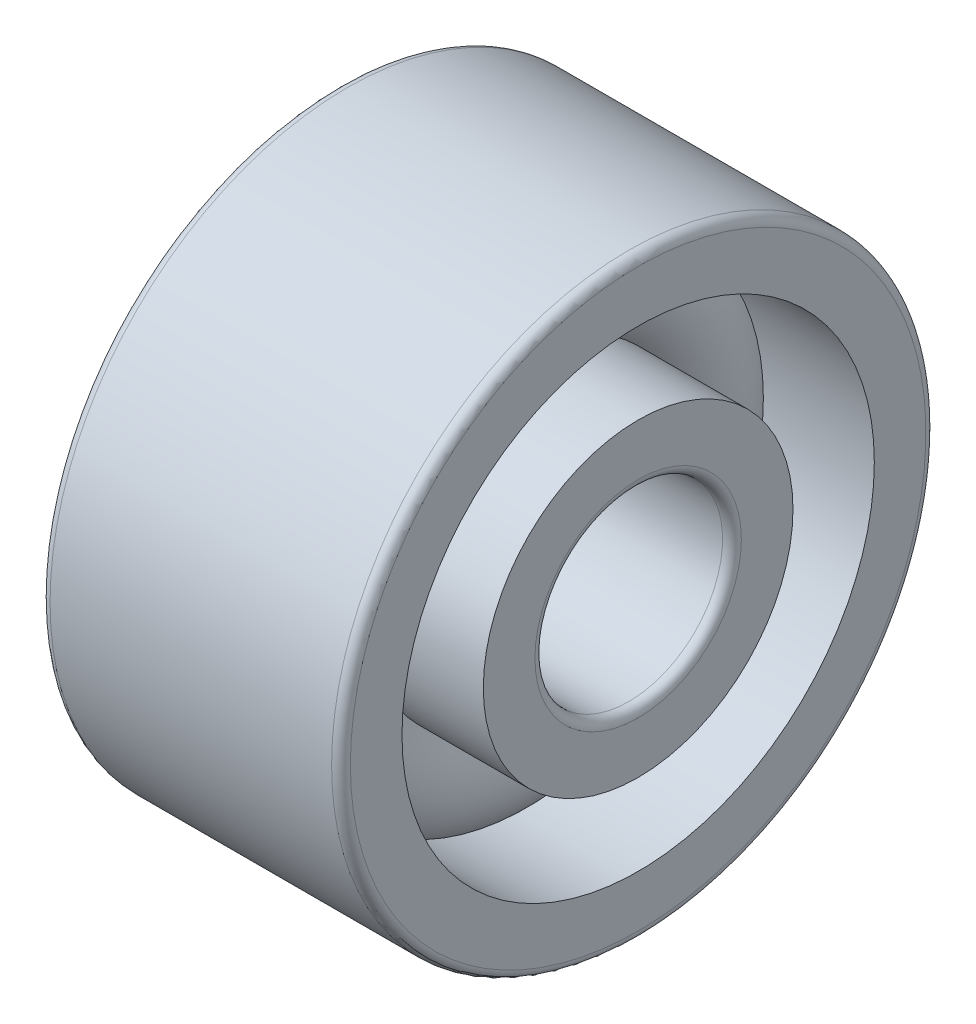
ISO-10303-21;
HEADER;
FILE_DESCRIPTION(('STEP AP214'),'2;1');
FILE_NAME('part.step','',(''),(''),'','','');
FILE_SCHEMA(('AUTOMOTIVE_DESIGN { 1 0 10303 214 1 1 1 1 }'));
ENDSEC;
DATA;
#1=APPLICATION_CONTEXT('core data for automotive mechanical design processes');
#2=APPLICATION_PROTOCOL_DEFINITION('international standard','automotive_design',2000,#1);
#3=PRODUCT_CONTEXT('',#1,'mechanical');
#4=PRODUCT('Part','Part','',(#3));
#5=PRODUCT_RELATED_PRODUCT_CATEGORY('part','',(#4));
#6=PRODUCT_DEFINITION_FORMATION('','',#4);
#7=PRODUCT_DEFINITION_CONTEXT('part definition',#1,'design');
#8=PRODUCT_DEFINITION('design','',#6,#7);
#9=PRODUCT_DEFINITION_SHAPE('','',#8);
#10=(LENGTH_UNIT() NAMED_UNIT(*) SI_UNIT(.MILLI.,.METRE.));
#11=(NAMED_UNIT(*) PLANE_ANGLE_UNIT() SI_UNIT($,.RADIAN.));
#12=(NAMED_UNIT(*) SI_UNIT($,.STERADIAN.) SOLID_ANGLE_UNIT());
#13=UNCERTAINTY_MEASURE_WITH_UNIT(LENGTH_MEASURE(1.E-05),#10,'distance_accuracy_value','');
#14=(GEOMETRIC_REPRESENTATION_CONTEXT(3) GLOBAL_UNCERTAINTY_ASSIGNED_CONTEXT((#13)) GLOBAL_UNIT_ASSIGNED_CONTEXT((#10,
#11,#12)) REPRESENTATION_CONTEXT('',''));
#15=CARTESIAN_POINT('',(0.,0.,0.));
#16=DIRECTION('',(0.,0.,1.));
#17=DIRECTION('',(1.,0.,0.));
#18=AXIS2_PLACEMENT_3D('',#15,#16,#17);
#19=CARTESIAN_POINT('',(-0.330345221603542,0.0292013881638322,0.115859753066161));
#20=DIRECTION('',(-1.,0.,0.));
#21=DIRECTION('',(0.,0.,1.));
#22=AXIS2_PLACEMENT_3D('',#19,#20,#21);
#23=TOROIDAL_SURFACE('',#22,8.33333333333334,2.6);
#24=CARTESIAN_POINT('',(1.60758035889628,0.0292013881638316,0.115859753066161));
#25=DIRECTION('',(-1.,0.,0.));
#26=DIRECTION('',(0.,0.,1.));
#27=AXIS2_PLACEMENT_3D('',#24,#25,#26);
#28=CIRCLE('',#27,6.6);
#29=CARTESIAN_POINT('',(1.60758035889628,0.0292013881638316,6.71585975306616));
#30=VERTEX_POINT('',#29);
#31=EDGE_CURVE('E10',#30,#30,#28,.T.);
#32=ORIENTED_EDGE('',*,*,#31,.T.);
#33=EDGE_LOOP('',(#32));
#34=FACE_BOUND('',#33,.T.);
#35=CARTESIAN_POINT('',(1.60758035889627,0.0292013881638316,0.115859753066161));
#36=DIRECTION('',(-1.,0.,0.));
#37=DIRECTION('',(0.,0.,1.));
#38=AXIS2_PLACEMENT_3D('',#35,#36,#37);
#39=CIRCLE('',#38,10.0666666666667);
#40=CARTESIAN_POINT('',(1.60758035889627,0.0292013881638316,10.1825264197328));
#41=VERTEX_POINT('',#40);
#42=EDGE_CURVE('E84',#41,#41,#39,.T.);
#43=ORIENTED_EDGE('',*,*,#42,.F.);
#44=EDGE_LOOP('',(#43));
#45=FACE_BOUND('',#44,.T.);
#46=ADVANCED_FACE('F32',(#34,#45),#23,.T.);
#47=CARTESIAN_POINT('',(6.33632144506313,0.0292013881638316,0.115859753066161));
#48=DIRECTION('',(-1.,0.,0.));
#49=DIRECTION('',(0.,0.,1.));
#50=AXIS2_PLACEMENT_3D('',#47,#48,#49);
#51=CYLINDRICAL_SURFACE('',#50,6.6);
#52=CARTESIAN_POINT('',(6.33632144506313,0.0292013881638316,0.115859753066161));
#53=DIRECTION('',(-1.,0.,0.));
#54=DIRECTION('',(0.,0.,1.));
#55=AXIS2_PLACEMENT_3D('',#52,#53,#54);
#56=CIRCLE('',#55,6.6);
#57=CARTESIAN_POINT('',(6.33632144506313,0.0292013881638316,6.71585975306616));
#58=VERTEX_POINT('',#57);
#59=EDGE_CURVE('E38',#58,#58,#56,.T.);
#60=ORIENTED_EDGE('',*,*,#59,.T.);
#61=EDGE_LOOP('',(#60));
#62=FACE_BOUND('',#61,.T.);
#63=ORIENTED_EDGE('',*,*,#31,.F.);
#64=EDGE_LOOP('',(#63));
#65=FACE_BOUND('',#64,.T.);
#66=ADVANCED_FACE('F92',(#62,#65),#51,.T.);
#67=CARTESIAN_POINT('',(6.33632144506313,6.62920138816383,0.115859753066161));
#68=DIRECTION('',(1.,0.,0.));
#69=DIRECTION('',(0.,0.,-1.));
#70=AXIS2_PLACEMENT_3D('',#67,#68,#69);
#71=PLANE('',#70);
#72=CARTESIAN_POINT('',(6.33632144506313,0.0292013881638316,0.115859753066161));
#73=DIRECTION('',(-1.,0.,0.));
#74=DIRECTION('',(0.,0.,1.));
#75=AXIS2_PLACEMENT_3D('',#72,#73,#74);
#76=CIRCLE('',#75,4.4);
#77=CARTESIAN_POINT('',(6.33632144506313,0.0292013881638316,4.51585975306616));
#78=VERTEX_POINT('',#77);
#79=EDGE_CURVE('E42',#78,#78,#76,.T.);
#80=ORIENTED_EDGE('',*,*,#79,.T.);
#81=EDGE_LOOP('',(#80));
#82=FACE_BOUND('',#81,.T.);
#83=ORIENTED_EDGE('',*,*,#59,.F.);
#84=EDGE_LOOP('',(#83));
#85=FACE_BOUND('',#84,.T.);
#86=ADVANCED_FACE('F96',(#82,#85),#71,.T.);
#87=CARTESIAN_POINT('',(5.93632144506313,0.0292013881638313,0.115859753066161));
#88=DIRECTION('',(-1.,0.,0.));
#89=DIRECTION('',(0.,0.,1.));
#90=AXIS2_PLACEMENT_3D('',#87,#88,#89);
#91=TOROIDAL_SURFACE('',#90,4.4,0.400000000000001);
#92=CARTESIAN_POINT('',(5.93632144506312,0.0292013881638316,0.115859753066161));
#93=DIRECTION('',(-1.,0.,0.));
#94=DIRECTION('',(0.,0.,1.));
#95=AXIS2_PLACEMENT_3D('',#92,#93,#94);
#96=CIRCLE('',#95,4.);
#97=CARTESIAN_POINT('',(5.93632144506312,0.0292013881638316,4.11585975306616));
#98=VERTEX_POINT('',#97);
#99=EDGE_CURVE('E46',#98,#98,#96,.T.);
#100=ORIENTED_EDGE('',*,*,#99,.T.);
#101=EDGE_LOOP('',(#100));
#102=FACE_BOUND('',#101,.T.);
#103=ORIENTED_EDGE('',*,*,#79,.F.);
#104=EDGE_LOOP('',(#103));
#105=FACE_BOUND('',#104,.T.);
#106=ADVANCED_FACE('F100',(#102,#105),#91,.T.);
#107=CARTESIAN_POINT('',(6.33632144506313,0.0292013881638316,0.115859753066161));
#108=DIRECTION('',(-1.,0.,0.));
#109=DIRECTION('',(0.,0.,1.));
#110=AXIS2_PLACEMENT_3D('',#107,#108,#109);
#111=CYLINDRICAL_SURFACE('',#110,4.);
#112=CARTESIAN_POINT('',(-6.06367855493687,0.0292013881638316,0.115859753066161));
#113=DIRECTION('',(-1.,0.,0.));
#114=DIRECTION('',(0.,0.,1.));
#115=AXIS2_PLACEMENT_3D('',#112,#113,#114);
#116=CIRCLE('',#115,4.);
#117=CARTESIAN_POINT('',(-6.06367855493687,0.0292013881638316,4.11585975306616));
#118=VERTEX_POINT('',#117);
#119=EDGE_CURVE('E51',#118,#118,#116,.T.);
#120=ORIENTED_EDGE('',*,*,#119,.T.);
#121=EDGE_LOOP('',(#120));
#122=FACE_BOUND('',#121,.T.);
#123=ORIENTED_EDGE('',*,*,#99,.F.);
#124=EDGE_LOOP('',(#123));
#125=FACE_BOUND('',#124,.T.);
#126=ADVANCED_FACE('F107',(#122,#125),#111,.F.);
#127=CARTESIAN_POINT('',(-6.06367855493687,0.0292013881638313,0.115859753066161));
#128=DIRECTION('',(-1.,0.,0.));
#129=DIRECTION('',(0.,0.,1.));
#130=AXIS2_PLACEMENT_3D('',#127,#128,#129);
#131=TOROIDAL_SURFACE('',#130,4.4,0.400000000000001);
#132=CARTESIAN_POINT('',(-6.46367855493687,0.0292013881638316,0.115859753066161));
#133=DIRECTION('',(-1.,0.,0.));
#134=DIRECTION('',(0.,0.,1.));
#135=AXIS2_PLACEMENT_3D('',#132,#133,#134);
#136=CIRCLE('',#135,4.4);
#137=CARTESIAN_POINT('',(-6.46367855493687,0.0292013881638316,4.51585975306616));
#138=VERTEX_POINT('',#137);
#139=EDGE_CURVE('E54',#138,#138,#136,.T.);
#140=ORIENTED_EDGE('',*,*,#139,.T.);
#141=EDGE_LOOP('',(#140));
#142=FACE_BOUND('',#141,.T.);
#143=ORIENTED_EDGE('',*,*,#119,.F.);
#144=EDGE_LOOP('',(#143));
#145=FACE_BOUND('',#144,.T.);
#146=ADVANCED_FACE('F111',(#142,#145),#131,.T.);
#147=CARTESIAN_POINT('',(-6.46367855493687,4.42920138816383,0.115859753066161));
#148=DIRECTION('',(-1.,0.,0.));
#149=DIRECTION('',(0.,0.,1.));
#150=AXIS2_PLACEMENT_3D('',#147,#148,#149);
#151=PLANE('',#150);
#152=CARTESIAN_POINT('',(-6.46367855493687,0.0292013881638316,0.115859753066161));
#153=DIRECTION('',(-1.,0.,0.));
#154=DIRECTION('',(0.,0.,1.));
#155=AXIS2_PLACEMENT_3D('',#152,#153,#154);
#156=CIRCLE('',#155,6.6);
#157=CARTESIAN_POINT('',(-6.46367855493687,0.0292013881638316,6.71585975306616));
#158=VERTEX_POINT('',#157);
#159=EDGE_CURVE('E57',#158,#158,#156,.T.);
#160=ORIENTED_EDGE('',*,*,#159,.T.);
#161=EDGE_LOOP('',(#160));
#162=FACE_BOUND('',#161,.T.);
#163=ORIENTED_EDGE('',*,*,#139,.F.);
#164=EDGE_LOOP('',(#163));
#165=FACE_BOUND('',#164,.T.);
#166=ADVANCED_FACE('F115',(#162,#165),#151,.T.);
#167=CARTESIAN_POINT('',(6.33632144506313,0.0292013881638316,0.115859753066161));
#168=DIRECTION('',(-1.,0.,0.));
#169=DIRECTION('',(0.,0.,1.));
#170=AXIS2_PLACEMENT_3D('',#167,#168,#169);
#171=CYLINDRICAL_SURFACE('',#170,6.6);
#172=CARTESIAN_POINT('',(-2.26827080210336,0.0292013881638316,0.115859753066161));
#173=DIRECTION('',(-1.,0.,0.));
#174=DIRECTION('',(0.,0.,1.));
#175=AXIS2_PLACEMENT_3D('',#172,#173,#174);
#176=CIRCLE('',#175,6.6);
#177=CARTESIAN_POINT('',(-2.26827080210336,0.0292013881638316,6.71585975306616));
#178=VERTEX_POINT('',#177);
#179=EDGE_CURVE('E60',#178,#178,#176,.T.);
#180=ORIENTED_EDGE('',*,*,#179,.T.);
#181=EDGE_LOOP('',(#180));
#182=FACE_BOUND('',#181,.T.);
#183=ORIENTED_EDGE('',*,*,#159,.F.);
#184=EDGE_LOOP('',(#183));
#185=FACE_BOUND('',#184,.T.);
#186=ADVANCED_FACE('F119',(#182,#185),#171,.T.);
#187=CARTESIAN_POINT('',(-0.330345221603542,0.0292013881638322,0.115859753066161));
#188=DIRECTION('',(-1.,0.,0.));
#189=DIRECTION('',(0.,0.,1.));
#190=AXIS2_PLACEMENT_3D('',#187,#188,#189);
#191=TOROIDAL_SURFACE('',#190,8.33333333333334,2.6);
#192=CARTESIAN_POINT('',(-2.26827080210335,0.0292013881638316,0.115859753066161));
#193=DIRECTION('',(-1.,0.,0.));
#194=DIRECTION('',(0.,0.,1.));
#195=AXIS2_PLACEMENT_3D('',#192,#193,#194);
#196=CIRCLE('',#195,10.0666666666667);
#197=CARTESIAN_POINT('',(-2.26827080210335,0.0292013881638316,10.1825264197328));
#198=VERTEX_POINT('',#197);
#199=EDGE_CURVE('E63',#198,#198,#196,.T.);
#200=ORIENTED_EDGE('',*,*,#199,.T.);
#201=EDGE_LOOP('',(#200));
#202=FACE_BOUND('',#201,.T.);
#203=ORIENTED_EDGE('',*,*,#179,.F.);
#204=EDGE_LOOP('',(#203));
#205=FACE_BOUND('',#204,.T.);
#206=ADVANCED_FACE('F123',(#202,#205),#191,.T.);
#207=CARTESIAN_POINT('',(6.33632144506313,0.0292013881638316,0.115859753066161));
#208=DIRECTION('',(-1.,0.,0.));
#209=DIRECTION('',(0.,0.,1.));
#210=AXIS2_PLACEMENT_3D('',#207,#208,#209);
#211=CYLINDRICAL_SURFACE('',#210,10.0666666666667);
#212=CARTESIAN_POINT('',(-6.46367855493687,0.0292013881638316,0.115859753066161));
#213=DIRECTION('',(-1.,0.,0.));
#214=DIRECTION('',(0.,0.,1.));
#215=AXIS2_PLACEMENT_3D('',#212,#213,#214);
#216=CIRCLE('',#215,10.0666666666667);
#217=CARTESIAN_POINT('',(-6.46367855493687,0.0292013881638316,10.1825264197328));
#218=VERTEX_POINT('',#217);
#219=EDGE_CURVE('E66',#218,#218,#216,.T.);
#220=ORIENTED_EDGE('',*,*,#219,.T.);
#221=EDGE_LOOP('',(#220));
#222=FACE_BOUND('',#221,.T.);
#223=ORIENTED_EDGE('',*,*,#199,.F.);
#224=EDGE_LOOP('',(#223));
#225=FACE_BOUND('',#224,.T.);
#226=ADVANCED_FACE('F127',(#222,#225),#211,.F.);
#227=CARTESIAN_POINT('',(-6.46367855493687,10.0958680548305,0.115859753066161));
#228=DIRECTION('',(-1.,0.,0.));
#229=DIRECTION('',(0.,0.,1.));
#230=AXIS2_PLACEMENT_3D('',#227,#228,#229);
#231=PLANE('',#230);
#232=CARTESIAN_POINT('',(-6.46367855493687,0.0292013881638316,0.115859753066161));
#233=DIRECTION('',(-1.,0.,0.));
#234=DIRECTION('',(0.,0.,1.));
#235=AXIS2_PLACEMENT_3D('',#232,#233,#234);
#236=CIRCLE('',#235,12.2666666666667);
#237=CARTESIAN_POINT('',(-6.46367855493687,0.0292013881638316,12.3825264197328));
#238=VERTEX_POINT('',#237);
#239=EDGE_CURVE('E69',#238,#238,#236,.T.);
#240=ORIENTED_EDGE('',*,*,#239,.T.);
#241=EDGE_LOOP('',(#240));
#242=FACE_BOUND('',#241,.T.);
#243=ORIENTED_EDGE('',*,*,#219,.F.);
#244=EDGE_LOOP('',(#243));
#245=FACE_BOUND('',#244,.T.);
#246=ADVANCED_FACE('F131',(#242,#245),#231,.T.);
#247=CARTESIAN_POINT('',(-6.06367855493687,0.0292013881638322,0.115859753066161));
#248=DIRECTION('',(-1.,0.,0.));
#249=DIRECTION('',(0.,0.,1.));
#250=AXIS2_PLACEMENT_3D('',#247,#248,#249);
#251=TOROIDAL_SURFACE('',#250,12.2666666666667,0.399999999999999);
#252=CARTESIAN_POINT('',(-6.06367855493687,0.0292013881638316,0.115859753066161));
#253=DIRECTION('',(-1.,0.,0.));
#254=DIRECTION('',(0.,0.,1.));
#255=AXIS2_PLACEMENT_3D('',#252,#253,#254);
#256=CIRCLE('',#255,12.6666666666667);
#257=CARTESIAN_POINT('',(-6.06367855493687,0.0292013881638316,12.7825264197328));
#258=VERTEX_POINT('',#257);
#259=EDGE_CURVE('E72',#258,#258,#256,.T.);
#260=ORIENTED_EDGE('',*,*,#259,.T.);
#261=EDGE_LOOP('',(#260));
#262=FACE_BOUND('',#261,.T.);
#263=ORIENTED_EDGE('',*,*,#239,.F.);
#264=EDGE_LOOP('',(#263));
#265=FACE_BOUND('',#264,.T.);
#266=ADVANCED_FACE('F135',(#262,#265),#251,.T.);
#267=CARTESIAN_POINT('',(6.33632144506313,0.0292013881638316,0.115859753066161));
#268=DIRECTION('',(-1.,0.,0.));
#269=DIRECTION('',(0.,0.,1.));
#270=AXIS2_PLACEMENT_3D('',#267,#268,#269);
#271=CYLINDRICAL_SURFACE('',#270,12.6666666666667);
#272=CARTESIAN_POINT('',(5.93632144506312,0.0292013881638316,0.115859753066161));
#273=DIRECTION('',(-1.,0.,0.));
#274=DIRECTION('',(0.,0.,1.));
#275=AXIS2_PLACEMENT_3D('',#272,#273,#274);
#276=CIRCLE('',#275,12.6666666666667);
#277=CARTESIAN_POINT('',(5.93632144506312,0.0292013881638316,12.7825264197328));
#278=VERTEX_POINT('',#277);
#279=EDGE_CURVE('E75',#278,#278,#276,.T.);
#280=ORIENTED_EDGE('',*,*,#279,.T.);
#281=EDGE_LOOP('',(#280));
#282=FACE_BOUND('',#281,.T.);
#283=ORIENTED_EDGE('',*,*,#259,.F.);
#284=EDGE_LOOP('',(#283));
#285=FACE_BOUND('',#284,.T.);
#286=ADVANCED_FACE('F139',(#282,#285),#271,.T.);
#287=CARTESIAN_POINT('',(5.93632144506313,0.0292013881638322,0.115859753066161));
#288=DIRECTION('',(-1.,0.,0.));
#289=DIRECTION('',(0.,0.,1.));
#290=AXIS2_PLACEMENT_3D('',#287,#288,#289);
#291=TOROIDAL_SURFACE('',#290,12.2666666666667,0.399999999999997);
#292=CARTESIAN_POINT('',(6.33632144506312,0.0292013881638316,0.115859753066161));
#293=DIRECTION('',(-1.,0.,0.));
#294=DIRECTION('',(0.,0.,1.));
#295=AXIS2_PLACEMENT_3D('',#292,#293,#294);
#296=CIRCLE('',#295,12.2666666666667);
#297=CARTESIAN_POINT('',(6.33632144506312,0.0292013881638316,12.3825264197328));
#298=VERTEX_POINT('',#297);
#299=EDGE_CURVE('E78',#298,#298,#296,.T.);
#300=ORIENTED_EDGE('',*,*,#299,.T.);
#301=EDGE_LOOP('',(#300));
#302=FACE_BOUND('',#301,.T.);
#303=ORIENTED_EDGE('',*,*,#279,.F.);
#304=EDGE_LOOP('',(#303));
#305=FACE_BOUND('',#304,.T.);
#306=ADVANCED_FACE('F143',(#302,#305),#291,.T.);
#307=CARTESIAN_POINT('',(6.33632144506312,12.2958680548305,0.115859753066161));
#308=DIRECTION('',(1.,0.,0.));
#309=DIRECTION('',(0.,0.,-1.));
#310=AXIS2_PLACEMENT_3D('',#307,#308,#309);
#311=PLANE('',#310);
#312=CARTESIAN_POINT('',(6.33632144506313,0.0292013881638316,0.115859753066161));
#313=DIRECTION('',(-1.,0.,0.));
#314=DIRECTION('',(0.,0.,1.));
#315=AXIS2_PLACEMENT_3D('',#312,#313,#314);
#316=CIRCLE('',#315,10.0666666666667);
#317=CARTESIAN_POINT('',(6.33632144506313,0.0292013881638316,10.1825264197328));
#318=VERTEX_POINT('',#317);
#319=EDGE_CURVE('E81',#318,#318,#316,.T.);
#320=ORIENTED_EDGE('',*,*,#319,.T.);
#321=EDGE_LOOP('',(#320));
#322=FACE_BOUND('',#321,.T.);
#323=ORIENTED_EDGE('',*,*,#299,.F.);
#324=EDGE_LOOP('',(#323));
#325=FACE_BOUND('',#324,.T.);
#326=ADVANCED_FACE('F147',(#322,#325),#311,.T.);
#327=CARTESIAN_POINT('',(6.33632144506313,0.0292013881638316,0.115859753066161));
#328=DIRECTION('',(-1.,0.,0.));
#329=DIRECTION('',(0.,0.,1.));
#330=AXIS2_PLACEMENT_3D('',#327,#328,#329);
#331=CYLINDRICAL_SURFACE('',#330,10.0666666666667);
#332=ORIENTED_EDGE('',*,*,#42,.T.);
#333=EDGE_LOOP('',(#332));
#334=FACE_BOUND('',#333,.T.);
#335=ORIENTED_EDGE('',*,*,#319,.F.);
#336=EDGE_LOOP('',(#335));
#337=FACE_BOUND('',#336,.T.);
#338=ADVANCED_FACE('F88',(#334,#337),#331,.F.);
#339=CLOSED_SHELL('',(#46,#66,#86,#106,#126,#146,#166,#186,#206,#226,#246,#266,#286,#306,#326,#338));
#340=MANIFOLD_SOLID_BREP('B2',#339);
#341=ADVANCED_BREP_SHAPE_REPRESENTATION('',(#18,#340),#14);
#342=SHAPE_DEFINITION_REPRESENTATION(#9,#341);
ENDSEC;
END-ISO-10303-21;
